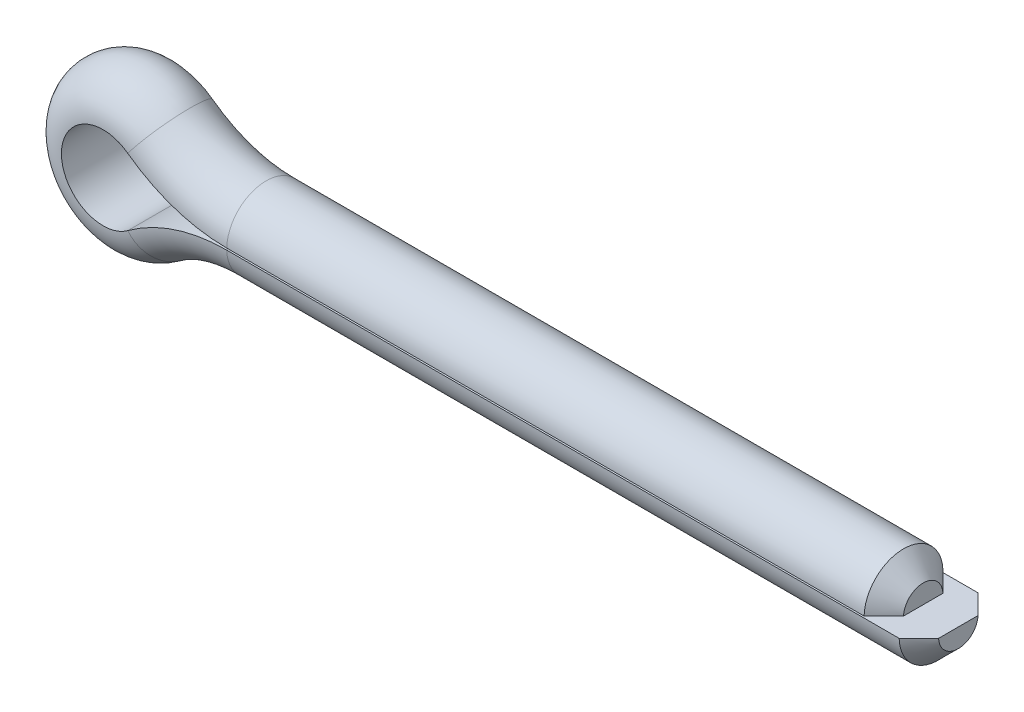
ISO-10303-21;
HEADER;
FILE_DESCRIPTION(('STEP AP214'),'2;1');
FILE_NAME('part.step','',(''),(''),'','','');
FILE_SCHEMA(('AUTOMOTIVE_DESIGN { 1 0 10303 214 1 1 1 1 }'));
ENDSEC;
DATA;
#1=APPLICATION_CONTEXT('core data for automotive mechanical design processes');
#2=APPLICATION_PROTOCOL_DEFINITION('international standard','automotive_design',2000,#1);
#3=PRODUCT_CONTEXT('',#1,'mechanical');
#4=PRODUCT('Part','Part','',(#3));
#5=PRODUCT_RELATED_PRODUCT_CATEGORY('part','',(#4));
#6=PRODUCT_DEFINITION_FORMATION('','',#4);
#7=PRODUCT_DEFINITION_CONTEXT('part definition',#1,'design');
#8=PRODUCT_DEFINITION('design','',#6,#7);
#9=PRODUCT_DEFINITION_SHAPE('','',#8);
#10=(LENGTH_UNIT() NAMED_UNIT(*) SI_UNIT(.MILLI.,.METRE.));
#11=(NAMED_UNIT(*) PLANE_ANGLE_UNIT() SI_UNIT($,.RADIAN.));
#12=(NAMED_UNIT(*) SI_UNIT($,.STERADIAN.) SOLID_ANGLE_UNIT());
#13=UNCERTAINTY_MEASURE_WITH_UNIT(LENGTH_MEASURE(1.E-05),#10,'distance_accuracy_value','');
#14=(GEOMETRIC_REPRESENTATION_CONTEXT(3) GLOBAL_UNCERTAINTY_ASSIGNED_CONTEXT((#13)) GLOBAL_UNIT_ASSIGNED_CONTEXT((#10,
#11,#12)) REPRESENTATION_CONTEXT('',''));
#15=CARTESIAN_POINT('',(0.,0.,0.));
#16=DIRECTION('',(0.,0.,1.));
#17=DIRECTION('',(1.,0.,0.));
#18=AXIS2_PLACEMENT_3D('',#15,#16,#17);
#19=CARTESIAN_POINT('',(1.016,0.000288636363636367,0.));
#20=DIRECTION('',(-1.,0.,0.));
#21=DIRECTION('',(0.,0.,-1.));
#22=AXIS2_PLACEMENT_3D('',#19,#20,#21);
#23=PLANE('',#22);
#24=DIRECTION('',(0.,0.,-1.));
#25=VECTOR('',#24,1.);
#26=CARTESIAN_POINT('',(1.016,-0.0254,1.143));
#27=LINE('',#26,#25);
#28=CARTESIAN_POINT('',(1.016,-0.0254000000000001,0.57121129071155));
#29=VERTEX_POINT('',#28);
#30=CARTESIAN_POINT('',(1.016,-0.0254000000000002,-0.57121129071155));
#31=VERTEX_POINT('',#30);
#32=EDGE_CURVE('E110',#29,#31,#27,.T.);
#33=ORIENTED_EDGE('',*,*,#32,.F.);
#34=CARTESIAN_POINT('',(1.016,0.000288636363636367,0.));
#35=DIRECTION('',(-1.,0.,0.));
#36=DIRECTION('',(0.,-1.,0.));
#37=AXIS2_PLACEMENT_3D('',#34,#35,#36);
#38=CIRCLE('',#37,0.571788636363629);
#39=EDGE_CURVE('E221',#29,#31,#38,.F.);
#40=ORIENTED_EDGE('',*,*,#39,.T.);
#41=EDGE_LOOP('',(#33,#40));
#42=FACE_BOUND('',#41,.T.);
#43=ADVANCED_FACE('F32',(#42),#23,.F.);
#44=CARTESIAN_POINT('',(0.,-0.000288636363636367,0.));
#45=DIRECTION('',(1.,0.,0.));
#46=DIRECTION('',(0.,0.,-1.));
#47=AXIS2_PLACEMENT_3D('',#44,#45,#46);
#48=PLANE('',#47);
#49=DIRECTION('',(0.,0.,-1.));
#50=VECTOR('',#49,1.);
#51=CARTESIAN_POINT('',(0.,0.0254,1.143));
#52=LINE('',#51,#50);
#53=CARTESIAN_POINT('',(0.,0.0254000000000001,0.571211290711557));
#54=VERTEX_POINT('',#53);
#55=CARTESIAN_POINT('',(0.,0.0254000000000002,-0.571211290711557));
#56=VERTEX_POINT('',#55);
#57=EDGE_CURVE('E157',#54,#56,#52,.T.);
#58=ORIENTED_EDGE('',*,*,#57,.T.);
#59=CARTESIAN_POINT('',(0.,-0.000288636363636367,0.));
#60=DIRECTION('',(1.,0.,0.));
#61=DIRECTION('',(0.,0.,-1.));
#62=AXIS2_PLACEMENT_3D('',#59,#60,#61);
#63=CIRCLE('',#62,0.571788636363636);
#64=EDGE_CURVE('E218',#56,#54,#63,.T.);
#65=ORIENTED_EDGE('',*,*,#64,.T.);
#66=EDGE_LOOP('',(#58,#65));
#67=FACE_BOUND('',#66,.T.);
#68=ADVANCED_FACE('F195',(#67),#48,.T.);
#69=CARTESIAN_POINT('',(1.016,0.000288636363636367,0.));
#70=DIRECTION('',(-1.,0.,0.));
#71=DIRECTION('',(0.,-1.,0.));
#72=AXIS2_PLACEMENT_3D('',#69,#70,#71);
#73=CYLINDRICAL_SURFACE('',#72,1.14328863636364);
#74=DIRECTION('',(-1.,0.,0.));
#75=VECTOR('',#74,1.);
#76=CARTESIAN_POINT('',(1.016,-0.0254000000000003,-1.143));
#77=LINE('',#76,#75);
#78=CARTESIAN_POINT('',(0.444499999999996,-0.0254000000000003,-1.143));
#79=VERTEX_POINT('',#78);
#80=CARTESIAN_POINT('',(-19.05,-0.0254000000000003,-1.143));
#81=VERTEX_POINT('',#80);
#82=EDGE_CURVE('E95',#79,#81,#77,.T.);
#83=ORIENTED_EDGE('',*,*,#82,.F.);
#84=CARTESIAN_POINT('',(0.444499999999996,0.000288636363636365,0.));
#85=DIRECTION('',(-1.,0.,0.));
#86=DIRECTION('',(0.,-1.,0.));
#87=AXIS2_PLACEMENT_3D('',#84,#85,#86);
#88=CIRCLE('',#87,1.14328863636364);
#89=CARTESIAN_POINT('',(0.444499999999996,-0.0254,1.143));
#90=VERTEX_POINT('',#89);
#91=EDGE_CURVE('E169',#79,#90,#88,.T.);
#92=ORIENTED_EDGE('',*,*,#91,.T.);
#93=DIRECTION('',(-1.,0.,0.));
#94=VECTOR('',#93,1.);
#95=CARTESIAN_POINT('',(1.016,-0.0254,1.143));
#96=LINE('',#95,#94);
#97=CARTESIAN_POINT('',(-19.05,-0.0254000000000001,1.143));
#98=VERTEX_POINT('',#97);
#99=EDGE_CURVE('E126',#90,#98,#96,.T.);
#100=ORIENTED_EDGE('',*,*,#99,.T.);
#101=CARTESIAN_POINT('',(-19.05,0.000288636363636293,0.));
#102=DIRECTION('',(-1.,0.,0.));
#103=DIRECTION('',(0.,0.,-1.));
#104=AXIS2_PLACEMENT_3D('',#101,#102,#103);
#105=CIRCLE('',#104,1.14328863636364);
#106=EDGE_CURVE('E109',#81,#98,#105,.T.);
#107=ORIENTED_EDGE('',*,*,#106,.F.);
#108=EDGE_LOOP('',(#83,#92,#100,#107));
#109=FACE_BOUND('',#108,.T.);
#110=ADVANCED_FACE('F128',(#109),#73,.T.);
#111=CARTESIAN_POINT('',(1.016,-0.0254,1.143));
#112=DIRECTION('',(0.,1.,0.));
#113=DIRECTION('',(0.,0.,1.));
#114=AXIS2_PLACEMENT_3D('',#111,#112,#113);
#115=PLANE('',#114);
#116=ORIENTED_EDGE('',*,*,#99,.F.);
#117=CARTESIAN_POINT('',(0.444499999999996,-0.0254,1.143));
#118=CARTESIAN_POINT('',(0.539766045931487,-0.0254,1.04771792006474));
#119=CARTESIAN_POINT('',(0.635024068784764,-0.0254,0.952427821102301));
#120=CARTESIAN_POINT('',(0.825524068784842,-0.0254,0.761831584672893));
#121=CARTESIAN_POINT('',(0.920766045931567,-0.0254,0.666525447205848));
#122=CARTESIAN_POINT('',(1.016,-0.0254000000000001,0.57121129071155));
#123=B_SPLINE_CURVE_WITH_KNOTS('',3,(#117,#118,#119,#120,#121,#122),.UNSPECIFIED.,.F.,.F.,(4,2,
4),(0.,0.40421361296186,0.808427227833183),.UNSPECIFIED.);
#124=EDGE_CURVE('E177',#90,#29,#123,.T.);
#125=ORIENTED_EDGE('',*,*,#124,.T.);
#126=ORIENTED_EDGE('',*,*,#32,.T.);
#127=CARTESIAN_POINT('',(1.016,-0.0254000000000002,-0.57121129071155));
#128=CARTESIAN_POINT('',(0.858166613638126,-0.0254000000000002,-0.729168037083594));
#129=CARTESIAN_POINT('',(0.700315153040808,-0.0254000000000002,-0.887106716706297));
#130=CARTESIAN_POINT('',(0.50979785178887,-0.0254000000000002,-1.07768565904979));
#131=CARTESIAN_POINT('',(0.477149312386185,-0.0254000000000003,-1.11034321585657));
#132=CARTESIAN_POINT('',(0.444499999999996,-0.0254000000000003,-1.143));
#133=B_SPLINE_CURVE_WITH_KNOTS('',3,(#127,#128,#129,#130,#131,#132),.UNSPECIFIED.,.F.,.F.,(4,2,
4),(0.,0.669892074294826,0.808427226063071),.UNSPECIFIED.);
#134=EDGE_CURVE('E104',#31,#79,#133,.T.);
#135=ORIENTED_EDGE('',*,*,#134,.T.);
#136=ORIENTED_EDGE('',*,*,#82,.T.);
#137=DIRECTION('',(0.,0.,-1.));
#138=VECTOR('',#137,1.);
#139=CARTESIAN_POINT('',(-19.05,-0.0254000000000001,1.143));
#140=LINE('',#139,#138);
#141=EDGE_CURVE('E100',#98,#81,#140,.T.);
#142=ORIENTED_EDGE('',*,*,#141,.F.);
#143=EDGE_LOOP('',(#116,#125,#126,#135,#136,#142));
#144=FACE_BOUND('',#143,.T.);
#145=ADVANCED_FACE('F98',(#144),#115,.T.);
#146=CARTESIAN_POINT('',(-19.05,-4.8514,0.));
#147=DIRECTION('',(0.,0.,1.));
#148=DIRECTION('',(1.,0.,0.));
#149=AXIS2_PLACEMENT_3D('',#146,#147,#148);
#150=TOROIDAL_SURFACE('',#149,4.85168863636364,1.14328863636364);
#151=CARTESIAN_POINT('',(-19.05,-4.8514,1.143));
#152=DIRECTION('',(0.,0.,1.));
#153=DIRECTION('',(0.,1.,0.));
#154=AXIS2_PLACEMENT_3D('',#151,#152,#153);
#155=CIRCLE('',#154,4.826);
#156=CARTESIAN_POINT('',(-21.9183067384086,-0.97028,1.143));
#157=VERTEX_POINT('',#156);
#158=EDGE_CURVE('E125',#98,#157,#155,.T.);
#159=ORIENTED_EDGE('',*,*,#158,.T.);
#160=CARTESIAN_POINT('',(-21.9335746391094,-0.949620928229665,0.));
#161=DIRECTION('',(-0.804210526315789,-0.594344537589841,0.));
#162=DIRECTION('',(0.,0.,-1.));
#163=AXIS2_PLACEMENT_3D('',#160,#161,#162);
#164=CIRCLE('',#163,1.14328863636364);
#165=CARTESIAN_POINT('',(-21.9183067384086,-0.97028,-1.143));
#166=VERTEX_POINT('',#165);
#167=EDGE_CURVE('E119',#166,#157,#164,.T.);
#168=ORIENTED_EDGE('',*,*,#167,.F.);
#169=CARTESIAN_POINT('',(-19.05,-4.8514,-1.143));
#170=DIRECTION('',(0.,0.,1.));
#171=DIRECTION('',(0.,1.,0.));
#172=AXIS2_PLACEMENT_3D('',#169,#170,#171);
#173=CIRCLE('',#172,4.826);
#174=EDGE_CURVE('E115',#81,#166,#173,.T.);
#175=ORIENTED_EDGE('',*,*,#174,.F.);
#176=ORIENTED_EDGE('',*,*,#106,.T.);
#177=EDGE_LOOP('',(#159,#168,#175,#176));
#178=FACE_BOUND('',#177,.T.);
#179=ADVANCED_FACE('F117',(#178),#150,.T.);
#180=CARTESIAN_POINT('',(-19.05,-4.8514,0.));
#181=DIRECTION('',(0.,0.,1.));
#182=DIRECTION('',(1.,0.,0.));
#183=AXIS2_PLACEMENT_3D('',#180,#181,#182);
#184=CYLINDRICAL_SURFACE('',#183,4.826);
#185=DIRECTION('',(0.,0.,-1.));
#186=VECTOR('',#185,1.);
#187=CARTESIAN_POINT('',(-21.9183067384086,-0.97028,1.143));
#188=LINE('',#187,#186);
#189=EDGE_CURVE('E133',#157,#166,#188,.T.);
#190=ORIENTED_EDGE('',*,*,#189,.F.);
#191=ORIENTED_EDGE('',*,*,#158,.F.);
#192=ORIENTED_EDGE('',*,*,#141,.T.);
#193=ORIENTED_EDGE('',*,*,#174,.T.);
#194=EDGE_LOOP('',(#190,#191,#192,#193));
#195=FACE_BOUND('',#194,.T.);
#196=ADVANCED_FACE('F124',(#195),#184,.T.);
#197=CARTESIAN_POINT('',(-22.6353834230107,0.,0.));
#198=DIRECTION('',(0.,0.,-1.));
#199=DIRECTION('',(-1.,0.,0.));
#200=AXIS2_PLACEMENT_3D('',#197,#198,#199);
#201=TOROIDAL_SURFACE('',#200,1.18081136363636,1.14328863636364);
#202=CARTESIAN_POINT('',(-22.6353834230107,0.,1.143));
#203=DIRECTION('',(0.,0.,-1.));
#204=DIRECTION('',(0.594344537589844,-0.804210526315787,0.));
#205=AXIS2_PLACEMENT_3D('',#202,#203,#204);
#206=CIRCLE('',#205,1.2065);
#207=CARTESIAN_POINT('',(-21.9183067384086,0.970280000000004,1.143));
#208=VERTEX_POINT('',#207);
#209=EDGE_CURVE('E138',#157,#208,#206,.T.);
#210=ORIENTED_EDGE('',*,*,#209,.T.);
#211=CARTESIAN_POINT('',(-21.9335746391094,0.949620928229668,0.));
#212=DIRECTION('',(0.804210526315793,-0.594344537589836,0.));
#213=DIRECTION('',(0.,0.,-1.));
#214=AXIS2_PLACEMENT_3D('',#211,#212,#213);
#215=CIRCLE('',#214,1.14328863636364);
#216=CARTESIAN_POINT('',(-21.9183067384086,0.970280000000004,-1.143));
#217=VERTEX_POINT('',#216);
#218=EDGE_CURVE('E135',#217,#208,#215,.T.);
#219=ORIENTED_EDGE('',*,*,#218,.F.);
#220=CARTESIAN_POINT('',(-22.6353834230107,0.,-1.143));
#221=DIRECTION('',(0.,0.,-1.));
#222=DIRECTION('',(0.594344537589844,-0.804210526315787,0.));
#223=AXIS2_PLACEMENT_3D('',#220,#221,#222);
#224=CIRCLE('',#223,1.2065);
#225=EDGE_CURVE('E139',#166,#217,#224,.T.);
#226=ORIENTED_EDGE('',*,*,#225,.F.);
#227=ORIENTED_EDGE('',*,*,#167,.T.);
#228=EDGE_LOOP('',(#210,#219,#226,#227));
#229=FACE_BOUND('',#228,.T.);
#230=ADVANCED_FACE('F265',(#229),#201,.T.);
#231=CARTESIAN_POINT('',(-22.6353834230107,0.,0.));
#232=DIRECTION('',(0.,0.,-1.));
#233=DIRECTION('',(-1.,0.,0.));
#234=AXIS2_PLACEMENT_3D('',#231,#232,#233);
#235=CYLINDRICAL_SURFACE('',#234,1.2065);
#236=DIRECTION('',(0.,0.,-1.));
#237=VECTOR('',#236,1.);
#238=CARTESIAN_POINT('',(-21.9183067384086,0.970280000000003,1.143));
#239=LINE('',#238,#237);
#240=EDGE_CURVE('E142',#208,#217,#239,.T.);
#241=ORIENTED_EDGE('',*,*,#240,.F.);
#242=ORIENTED_EDGE('',*,*,#209,.F.);
#243=ORIENTED_EDGE('',*,*,#189,.T.);
#244=ORIENTED_EDGE('',*,*,#225,.T.);
#245=EDGE_LOOP('',(#241,#242,#243,#244));
#246=FACE_BOUND('',#245,.T.);
#247=ADVANCED_FACE('F257',(#246),#235,.F.);
#248=CARTESIAN_POINT('',(-19.05,4.8514,0.));
#249=DIRECTION('',(0.,0.,1.));
#250=DIRECTION('',(1.,0.,0.));
#251=AXIS2_PLACEMENT_3D('',#248,#249,#250);
#252=TOROIDAL_SURFACE('',#251,4.85168863636363,1.14328863636364);
#253=CARTESIAN_POINT('',(-19.05,4.8514,1.143));
#254=DIRECTION('',(0.,0.,1.));
#255=DIRECTION('',(-0.594344537589841,-0.804210526315789,0.));
#256=AXIS2_PLACEMENT_3D('',#253,#254,#255);
#257=CIRCLE('',#256,4.826);
#258=CARTESIAN_POINT('',(-19.05,0.0253999999999975,1.143));
#259=VERTEX_POINT('',#258);
#260=EDGE_CURVE('E148',#208,#259,#257,.T.);
#261=ORIENTED_EDGE('',*,*,#260,.T.);
#262=CARTESIAN_POINT('',(-19.05,-0.000288636363638895,0.));
#263=DIRECTION('',(1.,0.,0.));
#264=DIRECTION('',(0.,0.,-1.));
#265=AXIS2_PLACEMENT_3D('',#262,#263,#264);
#266=CIRCLE('',#265,1.14328863636364);
#267=CARTESIAN_POINT('',(-19.05,0.0253999999999983,-1.143));
#268=VERTEX_POINT('',#267);
#269=EDGE_CURVE('E145',#268,#259,#266,.T.);
#270=ORIENTED_EDGE('',*,*,#269,.F.);
#271=CARTESIAN_POINT('',(-19.05,4.8514,-1.143));
#272=DIRECTION('',(0.,0.,1.));
#273=DIRECTION('',(-0.594344537589841,-0.804210526315789,0.));
#274=AXIS2_PLACEMENT_3D('',#271,#272,#273);
#275=CIRCLE('',#274,4.826);
#276=EDGE_CURVE('E149',#217,#268,#275,.T.);
#277=ORIENTED_EDGE('',*,*,#276,.F.);
#278=ORIENTED_EDGE('',*,*,#218,.T.);
#279=EDGE_LOOP('',(#261,#270,#277,#278));
#280=FACE_BOUND('',#279,.T.);
#281=ADVANCED_FACE('F249',(#280),#252,.T.);
#282=CARTESIAN_POINT('',(-19.05,4.8514,0.));
#283=DIRECTION('',(0.,0.,1.));
#284=DIRECTION('',(1.,0.,0.));
#285=AXIS2_PLACEMENT_3D('',#282,#283,#284);
#286=CYLINDRICAL_SURFACE('',#285,4.826);
#287=DIRECTION('',(0.,0.,-1.));
#288=VECTOR('',#287,1.);
#289=CARTESIAN_POINT('',(-19.05,0.0253999999999975,1.143));
#290=LINE('',#289,#288);
#291=EDGE_CURVE('E152',#259,#268,#290,.T.);
#292=ORIENTED_EDGE('',*,*,#291,.F.);
#293=ORIENTED_EDGE('',*,*,#260,.F.);
#294=ORIENTED_EDGE('',*,*,#240,.T.);
#295=ORIENTED_EDGE('',*,*,#276,.T.);
#296=EDGE_LOOP('',(#292,#293,#294,#295));
#297=FACE_BOUND('',#296,.T.);
#298=ADVANCED_FACE('F204',(#297),#286,.T.);
#299=CARTESIAN_POINT('',(-19.05,-0.000288636363638895,0.));
#300=DIRECTION('',(1.,0.,0.));
#301=DIRECTION('',(0.,1.,0.));
#302=AXIS2_PLACEMENT_3D('',#299,#300,#301);
#303=CYLINDRICAL_SURFACE('',#302,1.14328863636364);
#304=DIRECTION('',(1.,0.,0.));
#305=VECTOR('',#304,1.);
#306=CARTESIAN_POINT('',(-19.05,0.0253999999999975,1.143));
#307=LINE('',#306,#305);
#308=CARTESIAN_POINT('',(-0.571500000000003,0.0253999999999999,1.143));
#309=VERTEX_POINT('',#308);
#310=EDGE_CURVE('E155',#259,#309,#307,.T.);
#311=ORIENTED_EDGE('',*,*,#310,.T.);
#312=CARTESIAN_POINT('',(-0.571500000000003,-0.000288636363636443,0.));
#313=DIRECTION('',(1.,0.,0.));
#314=DIRECTION('',(0.,1.,0.));
#315=AXIS2_PLACEMENT_3D('',#312,#313,#314);
#316=CIRCLE('',#315,1.14328863636364);
#317=CARTESIAN_POINT('',(-0.571500000000003,0.0254000000000002,-1.143));
#318=VERTEX_POINT('',#317);
#319=EDGE_CURVE('E11',#309,#318,#316,.F.);
#320=ORIENTED_EDGE('',*,*,#319,.T.);
#321=DIRECTION('',(1.,0.,0.));
#322=VECTOR('',#321,1.);
#323=CARTESIAN_POINT('',(-19.05,0.0253999999999977,-1.143));
#324=LINE('',#323,#322);
#325=EDGE_CURVE('E158',#268,#318,#324,.T.);
#326=ORIENTED_EDGE('',*,*,#325,.F.);
#327=ORIENTED_EDGE('',*,*,#269,.T.);
#328=EDGE_LOOP('',(#311,#320,#326,#327));
#329=FACE_BOUND('',#328,.T.);
#330=ADVANCED_FACE('F203',(#329),#303,.T.);
#331=CARTESIAN_POINT('',(-19.05,0.0253999999999975,1.143));
#332=DIRECTION('',(0.,-1.,0.));
#333=DIRECTION('',(1.,0.,0.));
#334=AXIS2_PLACEMENT_3D('',#331,#332,#333);
#335=PLANE('',#334);
#336=ORIENTED_EDGE('',*,*,#57,.F.);
#337=CARTESIAN_POINT('',(0.,0.0254000000000001,0.571211290711557));
#338=CARTESIAN_POINT('',(-0.15783338636188,0.0254,0.729168037083602));
#339=CARTESIAN_POINT('',(-0.3156848469592,0.0254,0.887106716706308));
#340=CARTESIAN_POINT('',(-0.506202148211137,0.0253999999999999,1.07768565904979));
#341=CARTESIAN_POINT('',(-0.538850687613818,0.0253999999999999,1.11034321585657));
#342=CARTESIAN_POINT('',(-0.571500000000002,0.0253999999999999,1.143));
#343=B_SPLINE_CURVE_WITH_KNOTS('',3,(#337,#338,#339,#340,#341,#342),.UNSPECIFIED.,.F.,.F.,(4,2,
4),(0.,0.669892074294835,0.808427226063062),.UNSPECIFIED.);
#344=EDGE_CURVE('E41',#54,#309,#343,.T.);
#345=ORIENTED_EDGE('',*,*,#344,.T.);
#346=ORIENTED_EDGE('',*,*,#310,.F.);
#347=ORIENTED_EDGE('',*,*,#291,.T.);
#348=ORIENTED_EDGE('',*,*,#325,.T.);
#349=CARTESIAN_POINT('',(-0.571500000000003,0.0254000000000002,-1.143));
#350=CARTESIAN_POINT('',(-0.476233954068512,0.0254000000000002,-1.04771792006474));
#351=CARTESIAN_POINT('',(-0.380975931215236,0.0254000000000002,-0.952427821102304));
#352=CARTESIAN_POINT('',(-0.190475931215159,0.0254000000000002,-0.761831584672898));
#353=CARTESIAN_POINT('',(-0.0952339540684349,0.0254000000000002,-0.666525447205854));
#354=CARTESIAN_POINT('',(0.,0.0254000000000002,-0.571211290711557));
#355=B_SPLINE_CURVE_WITH_KNOTS('',3,(#349,#350,#351,#352,#353,#354),.UNSPECIFIED.,.F.,.F.,(4,2,
4),(0.,0.404213612961856,0.808427227833175),.UNSPECIFIED.);
#356=EDGE_CURVE('E208',#318,#56,#355,.T.);
#357=ORIENTED_EDGE('',*,*,#356,.T.);
#358=EDGE_LOOP('',(#336,#345,#346,#347,#348,#357));
#359=FACE_BOUND('',#358,.T.);
#360=ADVANCED_FACE('F190',(#359),#335,.T.);
#361=CARTESIAN_POINT('',(0.444499999999996,0.000288636363636365,0.));
#362=DIRECTION('',(-1.,0.,0.));
#363=DIRECTION('',(0.,-1.,0.));
#364=AXIS2_PLACEMENT_3D('',#361,#362,#363);
#365=CONICAL_SURFACE('',#364,1.14328863636364,0.785398163397449);
#366=ORIENTED_EDGE('',*,*,#134,.F.);
#367=ORIENTED_EDGE('',*,*,#39,.F.);
#368=ORIENTED_EDGE('',*,*,#124,.F.);
#369=ORIENTED_EDGE('',*,*,#91,.F.);
#370=EDGE_LOOP('',(#366,#367,#368,#369));
#371=FACE_BOUND('',#370,.T.);
#372=ADVANCED_FACE('F186',(#371),#365,.T.);
#373=CARTESIAN_POINT('',(0.,-0.000288636363636367,0.));
#374=DIRECTION('',(-1.,0.,0.));
#375=DIRECTION('',(0.,-1.,0.));
#376=AXIS2_PLACEMENT_3D('',#373,#374,#375);
#377=CONICAL_SURFACE('',#376,0.571788636363636,0.785398163397447);
#378=ORIENTED_EDGE('',*,*,#356,.F.);
#379=ORIENTED_EDGE('',*,*,#319,.F.);
#380=ORIENTED_EDGE('',*,*,#344,.F.);
#381=ORIENTED_EDGE('',*,*,#64,.F.);
#382=EDGE_LOOP('',(#378,#379,#380,#381));
#383=FACE_BOUND('',#382,.T.);
#384=ADVANCED_FACE('F34',(#383),#377,.T.);
#385=CLOSED_SHELL('',(#43,#68,#110,#145,#179,#196,#230,#247,#281,#298,#330,#360,#372,#384));
#386=MANIFOLD_SOLID_BREP('B2',#385);
#387=ADVANCED_BREP_SHAPE_REPRESENTATION('',(#18,#386),#14);
#388=SHAPE_DEFINITION_REPRESENTATION(#9,#387);
ENDSEC;
END-ISO-10303-21;
